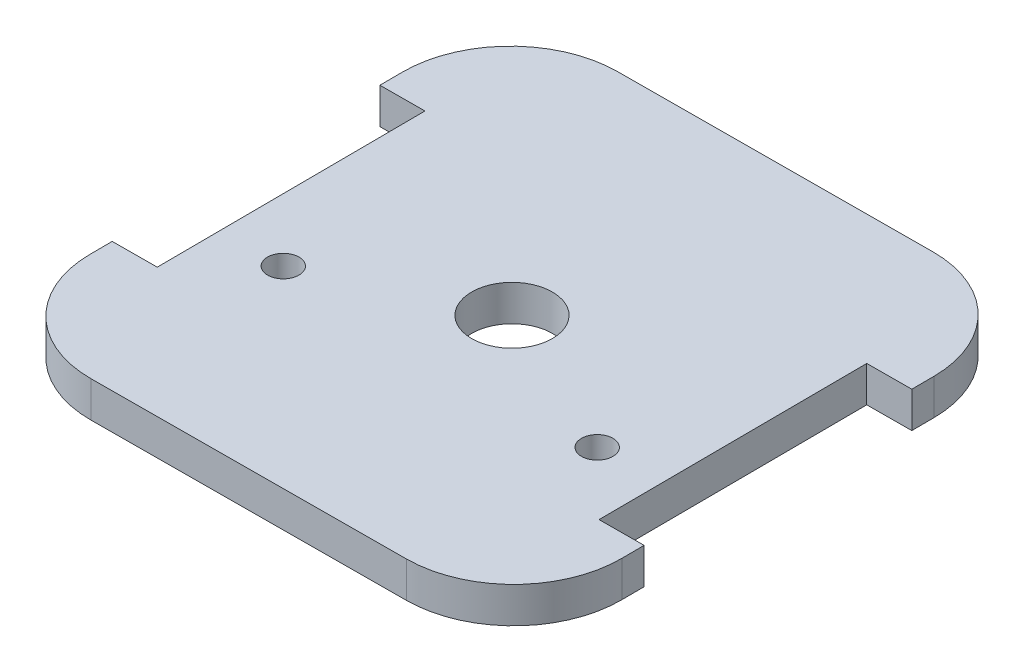
ISO-10303-21;
HEADER;
FILE_DESCRIPTION(('STEP AP214'),'2;1');
FILE_NAME('part.step','',(''),(''),'','','');
FILE_SCHEMA(('AUTOMOTIVE_DESIGN { 1 0 10303 214 1 1 1 1 }'));
ENDSEC;
DATA;
#1=APPLICATION_CONTEXT('core data for automotive mechanical design processes');
#2=APPLICATION_PROTOCOL_DEFINITION('international standard','automotive_design',2000,#1);
#3=PRODUCT_CONTEXT('',#1,'mechanical');
#4=PRODUCT('Part','Part','',(#3));
#5=PRODUCT_RELATED_PRODUCT_CATEGORY('part','',(#4));
#6=PRODUCT_DEFINITION_FORMATION('','',#4);
#7=PRODUCT_DEFINITION_CONTEXT('part definition',#1,'design');
#8=PRODUCT_DEFINITION('design','',#6,#7);
#9=PRODUCT_DEFINITION_SHAPE('','',#8);
#10=(LENGTH_UNIT() NAMED_UNIT(*) SI_UNIT(.MILLI.,.METRE.));
#11=(NAMED_UNIT(*) PLANE_ANGLE_UNIT() SI_UNIT($,.RADIAN.));
#12=(NAMED_UNIT(*) SI_UNIT($,.STERADIAN.) SOLID_ANGLE_UNIT());
#13=UNCERTAINTY_MEASURE_WITH_UNIT(LENGTH_MEASURE(1.E-05),#10,'distance_accuracy_value','');
#14=(GEOMETRIC_REPRESENTATION_CONTEXT(3) GLOBAL_UNCERTAINTY_ASSIGNED_CONTEXT((#13)) GLOBAL_UNIT_ASSIGNED_CONTEXT((#10,
#11,#12)) REPRESENTATION_CONTEXT('',''));
#15=CARTESIAN_POINT('',(0.,0.,0.));
#16=DIRECTION('',(0.,0.,1.));
#17=DIRECTION('',(1.,0.,0.));
#18=AXIS2_PLACEMENT_3D('',#15,#16,#17);
#19=CARTESIAN_POINT('',(17.1808532086742,4.,16.1819370143056));
#20=DIRECTION('',(0.,1.,0.));
#21=DIRECTION('',(0.,0.,1.));
#22=AXIS2_PLACEMENT_3D('',#19,#20,#21);
#23=PLANE('',#22);
#24=CARTESIAN_POINT('',(-17.9091860285323,4.,6.77244191439073));
#25=DIRECTION('',(0.,1.,0.));
#26=DIRECTION('',(0.,0.,1.));
#27=AXIS2_PLACEMENT_3D('',#24,#25,#26);
#28=CIRCLE('',#27,1.75);
#29=CARTESIAN_POINT('',(-17.9091860285323,4.,8.52244191439073));
#30=VERTEX_POINT('',#29);
#31=EDGE_CURVE('E274',#30,#30,#28,.T.);
#32=ORIENTED_EDGE('',*,*,#31,.F.);
#33=EDGE_LOOP('',(#32));
#34=FACE_BOUND('',#33,.T.);
#35=CARTESIAN_POINT('',(17.0908139714677,4.,6.77244191439073));
#36=DIRECTION('',(0.,1.,0.));
#37=DIRECTION('',(0.,0.,1.));
#38=AXIS2_PLACEMENT_3D('',#35,#36,#37);
#39=CIRCLE('',#38,1.75);
#40=CARTESIAN_POINT('',(17.0908139714677,4.,8.52244191439073));
#41=VERTEX_POINT('',#40);
#42=EDGE_CURVE('E194',#41,#41,#39,.T.);
#43=ORIENTED_EDGE('',*,*,#42,.F.);
#44=EDGE_LOOP('',(#43));
#45=FACE_BOUND('',#44,.T.);
#46=CARTESIAN_POINT('',(-0.409186028532349,4.,-1.22755808559696));
#47=DIRECTION('',(0.,1.,0.));
#48=DIRECTION('',(0.,0.,1.));
#49=AXIS2_PLACEMENT_3D('',#46,#47,#48);
#50=CIRCLE('',#49,4.5);
#51=CARTESIAN_POINT('',(-0.409186028532349,4.,3.27244191440304));
#52=VERTEX_POINT('',#51);
#53=EDGE_CURVE('E268',#52,#52,#50,.T.);
#54=ORIENTED_EDGE('',*,*,#53,.F.);
#55=EDGE_LOOP('',(#54));
#56=FACE_BOUND('',#55,.T.);
#57=DIRECTION('',(0.00515840392296965,0.,0.999986695345977));
#58=VECTOR('',#57,1.);
#59=CARTESIAN_POINT('',(-29.9990656098906,4.,-18.5751523384239));
#60=LINE('',#59,#58);
#61=CARTESIAN_POINT('',(-29.9990656098906,4.,-18.5751523384239));
#62=VERTEX_POINT('',#61);
#63=CARTESIAN_POINT('',(-29.9861706295586,4.,-16.0753851698693));
#64=VERTEX_POINT('',#63);
#65=EDGE_CURVE('E171',#62,#64,#60,.T.);
#66=ORIENTED_EDGE('',*,*,#65,.T.);
#67=DIRECTION('',(0.999986695345977,0.,-0.00515840392297031));
#68=VECTOR('',#67,1.);
#69=CARTESIAN_POINT('',(-0.0837201326007428,4.,-16.229636140075));
#70=LINE('',#69,#68);
#71=CARTESIAN_POINT('',(-24.9862371528287,4.,-16.1011771894842));
#72=VERTEX_POINT('',#71);
#73=EDGE_CURVE('E152',#64,#72,#70,.T.);
#74=ORIENTED_EDGE('',*,*,#73,.T.);
#75=DIRECTION('',(0.00515840392297073,0.,0.999986695345977));
#76=VECTOR('',#75,1.);
#77=CARTESIAN_POINT('',(-24.902517020228,4.,0.128458950590883));
#78=LINE('',#77,#76);
#79=CARTESIAN_POINT('',(-24.8314829761888,4.,13.8988228105158));
#80=VERTEX_POINT('',#79);
#81=EDGE_CURVE('E305',#72,#80,#78,.T.);
#82=ORIENTED_EDGE('',*,*,#81,.T.);
#83=DIRECTION('',(0.999986695345977,0.,-0.00515840392297124));
#84=VECTOR('',#83,1.);
#85=CARTESIAN_POINT('',(0.0710340440391579,4.,13.7703638599249));
#86=LINE('',#85,#84);
#87=CARTESIAN_POINT('',(-29.8314164529187,4.,13.9246148301307));
#88=VERTEX_POINT('',#87);
#89=EDGE_CURVE('E163',#88,#80,#86,.T.);
#90=ORIENTED_EDGE('',*,*,#89,.F.);
#91=CARTESIAN_POINT('',(-29.8185214725867,4.,16.4243819986851));
#92=VERTEX_POINT('',#91);
#93=EDGE_CURVE('E181',#88,#92,#60,.T.);
#94=ORIENTED_EDGE('',*,*,#93,.T.);
#95=CARTESIAN_POINT('',(-17.818681128435,4.,16.3624811516096));
#96=DIRECTION('',(0.,1.,0.));
#97=DIRECTION('',(0.,0.,1.));
#98=AXIS2_PLACEMENT_3D('',#95,#96,#97);
#99=CIRCLE('',#98,12.);
#100=CARTESIAN_POINT('',(-17.7567802813592,4.,28.3623214957613));
#101=VERTEX_POINT('',#100);
#102=EDGE_CURVE('E180',#92,#101,#99,.T.);
#103=ORIENTED_EDGE('',*,*,#102,.T.);
#104=DIRECTION('',(0.999986695345977,0.,-0.00515840392297005));
#105=VECTOR('',#104,1.);
#106=CARTESIAN_POINT('',(-17.7567802813592,4.,28.3623214957613));
#107=LINE('',#106,#105);
#108=CARTESIAN_POINT('',(17.2427540557498,4.,28.1817773584574));
#109=VERTEX_POINT('',#108);
#110=EDGE_CURVE('E183',#101,#109,#107,.T.);
#111=ORIENTED_EDGE('',*,*,#110,.T.);
#112=CARTESIAN_POINT('',(17.1808532086742,4.,16.1819370143056));
#113=DIRECTION('',(0.,1.,0.));
#114=DIRECTION('',(0.,0.,1.));
#115=AXIS2_PLACEMENT_3D('',#112,#113,#114);
#116=CIRCLE('',#115,12.);
#117=CARTESIAN_POINT('',(29.1806935528259,4.,16.12003616723));
#118=VERTEX_POINT('',#117);
#119=EDGE_CURVE('E210',#109,#118,#116,.T.);
#120=ORIENTED_EDGE('',*,*,#119,.T.);
#121=DIRECTION('',(-0.00515840392296844,0.,-0.999986695345977));
#122=VECTOR('',#121,1.);
#123=CARTESIAN_POINT('',(29.1806935528259,4.,16.12003616723));
#124=LINE('',#123,#122);
#125=CARTESIAN_POINT('',(29.1677985724939,4.,13.6202689986705));
#126=VERTEX_POINT('',#125);
#127=EDGE_CURVE('E287',#118,#126,#124,.T.);
#128=ORIENTED_EDGE('',*,*,#127,.T.);
#129=DIRECTION('',(-0.999986695345977,0.,0.00515840392296916));
#130=VECTOR('',#129,1.);
#131=CARTESIAN_POINT('',(0.0710340440391293,4.,13.7703638599249));
#132=LINE('',#131,#130);
#133=CARTESIAN_POINT('',(24.167865095764,4.,13.6460610182903));
#134=VERTEX_POINT('',#133);
#135=EDGE_CURVE('E55',#126,#134,#132,.T.);
#136=ORIENTED_EDGE('',*,*,#135,.T.);
#137=DIRECTION('',(0.00515840392296934,0.,0.999986695345977));
#138=VECTOR('',#137,1.);
#139=CARTESIAN_POINT('',(24.0968310517249,4.,-0.124302841634649));
#140=LINE('',#139,#138);
#141=CARTESIAN_POINT('',(24.0131109191242,4.,-16.3539389817097));
#142=VERTEX_POINT('',#141);
#143=EDGE_CURVE('E259',#142,#134,#140,.T.);
#144=ORIENTED_EDGE('',*,*,#143,.F.);
#145=DIRECTION('',(-0.999986695345977,0.,0.00515840392296963));
#146=VECTOR('',#145,1.);
#147=CARTESIAN_POINT('',(-0.0837201326007317,4.,-16.229636140075));
#148=LINE('',#147,#146);
#149=CARTESIAN_POINT('',(29.0130443958541,4.,-16.3797310013246));
#150=VERTEX_POINT('',#149);
#151=EDGE_CURVE('E255',#150,#142,#148,.T.);
#152=ORIENTED_EDGE('',*,*,#151,.F.);
#153=CARTESIAN_POINT('',(29.000149415522,4.,-18.879498169879));
#154=VERTEX_POINT('',#153);
#155=EDGE_CURVE('E286',#150,#154,#124,.T.);
#156=ORIENTED_EDGE('',*,*,#155,.T.);
#157=CARTESIAN_POINT('',(17.0003090713703,4.,-18.8175973228035));
#158=DIRECTION('',(0.,1.,0.));
#159=DIRECTION('',(0.,0.,1.));
#160=AXIS2_PLACEMENT_3D('',#157,#158,#159);
#161=CIRCLE('',#160,12.);
#162=CARTESIAN_POINT('',(16.9384082242946,4.,-30.8174376669553));
#163=VERTEX_POINT('',#162);
#164=EDGE_CURVE('E290',#154,#163,#161,.T.);
#165=ORIENTED_EDGE('',*,*,#164,.T.);
#166=DIRECTION('',(-0.999986695345977,0.,0.00515840392297005));
#167=VECTOR('',#166,1.);
#168=CARTESIAN_POINT('',(16.9384082242946,4.,-30.8174376669553));
#169=LINE('',#168,#167);
#170=CARTESIAN_POINT('',(-18.0611261128144,4.,-30.6368935296513));
#171=VERTEX_POINT('',#170);
#172=EDGE_CURVE('E291',#163,#171,#169,.T.);
#173=ORIENTED_EDGE('',*,*,#172,.T.);
#174=CARTESIAN_POINT('',(-17.9992252657389,4.,-18.6370531854996));
#175=DIRECTION('',(0.,1.,0.));
#176=DIRECTION('',(0.,0.,1.));
#177=AXIS2_PLACEMENT_3D('',#174,#175,#176);
#178=CIRCLE('',#177,12.);
#179=EDGE_CURVE('E178',#171,#62,#178,.T.);
#180=ORIENTED_EDGE('',*,*,#179,.T.);
#181=EDGE_LOOP('',(#66,#74,#82,#90,#94,#103,#111,#120,#128,#136,#144,#152,#156,#165,#173,#180));
#182=FACE_BOUND('',#181,.T.);
#183=ADVANCED_FACE('F40',(#34,#45,#56,#182),#23,.T.);
#184=CARTESIAN_POINT('',(17.1808532086742,0.,16.1819370143056));
#185=DIRECTION('',(0.,1.,0.));
#186=DIRECTION('',(0.,0.,1.));
#187=AXIS2_PLACEMENT_3D('',#184,#185,#186);
#188=PLANE('',#187);
#189=CARTESIAN_POINT('',(-0.409186028532349,0.,-1.22755808559696));
#190=DIRECTION('',(0.,1.,0.));
#191=DIRECTION('',(0.,0.,1.));
#192=AXIS2_PLACEMENT_3D('',#189,#190,#191);
#193=CIRCLE('',#192,4.5);
#194=CARTESIAN_POINT('',(-0.409186028532349,0.,3.27244191440304));
#195=VERTEX_POINT('',#194);
#196=EDGE_CURVE('E267',#195,#195,#193,.T.);
#197=ORIENTED_EDGE('',*,*,#196,.T.);
#198=EDGE_LOOP('',(#197));
#199=FACE_BOUND('',#198,.T.);
#200=CARTESIAN_POINT('',(-17.9091860285323,0.,6.77244191439073));
#201=DIRECTION('',(0.,1.,0.));
#202=DIRECTION('',(0.,0.,1.));
#203=AXIS2_PLACEMENT_3D('',#200,#201,#202);
#204=CIRCLE('',#203,1.75);
#205=CARTESIAN_POINT('',(-17.9091860285323,0.,8.52244191439073));
#206=VERTEX_POINT('',#205);
#207=EDGE_CURVE('E271',#206,#206,#204,.T.);
#208=ORIENTED_EDGE('',*,*,#207,.T.);
#209=EDGE_LOOP('',(#208));
#210=FACE_BOUND('',#209,.T.);
#211=CARTESIAN_POINT('',(17.0908139714677,0.,6.77244191439073));
#212=DIRECTION('',(0.,1.,0.));
#213=DIRECTION('',(0.,0.,1.));
#214=AXIS2_PLACEMENT_3D('',#211,#212,#213);
#215=CIRCLE('',#214,1.75);
#216=CARTESIAN_POINT('',(17.0908139714677,0.,8.52244191439073));
#217=VERTEX_POINT('',#216);
#218=EDGE_CURVE('E277',#217,#217,#215,.T.);
#219=ORIENTED_EDGE('',*,*,#218,.T.);
#220=EDGE_LOOP('',(#219));
#221=FACE_BOUND('',#220,.T.);
#222=DIRECTION('',(0.999986695345977,0.,-0.00515840392297031));
#223=VECTOR('',#222,1.);
#224=CARTESIAN_POINT('',(17.0132040517023,0.,-16.3178301542489));
#225=LINE('',#224,#223);
#226=CARTESIAN_POINT('',(-29.9861706295586,0.,-16.0753851698693));
#227=VERTEX_POINT('',#226);
#228=CARTESIAN_POINT('',(-24.9862371528287,0.,-16.1011771894842));
#229=VERTEX_POINT('',#228);
#230=EDGE_CURVE('E263',#227,#229,#225,.T.);
#231=ORIENTED_EDGE('',*,*,#230,.F.);
#232=DIRECTION('',(0.00515840392296965,0.,0.999986695345977));
#233=VECTOR('',#232,1.);
#234=CARTESIAN_POINT('',(-29.9990656098906,0.,-18.5751523384239));
#235=LINE('',#234,#233);
#236=CARTESIAN_POINT('',(-29.9990656098906,0.,-18.5751523384239));
#237=VERTEX_POINT('',#236);
#238=EDGE_CURVE('E173',#237,#227,#235,.T.);
#239=ORIENTED_EDGE('',*,*,#238,.F.);
#240=CARTESIAN_POINT('',(-17.9992252657389,0.,-18.6370531854996));
#241=DIRECTION('',(0.,1.,0.));
#242=DIRECTION('',(0.,0.,1.));
#243=AXIS2_PLACEMENT_3D('',#240,#241,#242);
#244=CIRCLE('',#243,12.);
#245=CARTESIAN_POINT('',(-18.0611261128144,0.,-30.6368935296513));
#246=VERTEX_POINT('',#245);
#247=EDGE_CURVE('E202',#246,#237,#244,.T.);
#248=ORIENTED_EDGE('',*,*,#247,.F.);
#249=DIRECTION('',(-0.999986695345977,0.,0.00515840392297005));
#250=VECTOR('',#249,1.);
#251=CARTESIAN_POINT('',(16.9384082242946,0.,-30.8174376669553));
#252=LINE('',#251,#250);
#253=CARTESIAN_POINT('',(16.9384082242946,0.,-30.8174376669553));
#254=VERTEX_POINT('',#253);
#255=EDGE_CURVE('E200',#254,#246,#252,.T.);
#256=ORIENTED_EDGE('',*,*,#255,.F.);
#257=CARTESIAN_POINT('',(17.0003090713703,0.,-18.8175973228035));
#258=DIRECTION('',(0.,1.,0.));
#259=DIRECTION('',(0.,0.,1.));
#260=AXIS2_PLACEMENT_3D('',#257,#258,#259);
#261=CIRCLE('',#260,12.);
#262=CARTESIAN_POINT('',(29.000149415522,0.,-18.879498169879));
#263=VERTEX_POINT('',#262);
#264=EDGE_CURVE('E198',#263,#254,#261,.T.);
#265=ORIENTED_EDGE('',*,*,#264,.F.);
#266=DIRECTION('',(-0.00515840392297006,0.,-0.999986695345977));
#267=VECTOR('',#266,1.);
#268=CARTESIAN_POINT('',(29.090421484174,0.,-1.3797310013246));
#269=LINE('',#268,#267);
#270=CARTESIAN_POINT('',(29.0130443958541,0.,-16.3797310013246));
#271=VERTEX_POINT('',#270);
#272=EDGE_CURVE('E193',#271,#263,#269,.T.);
#273=ORIENTED_EDGE('',*,*,#272,.F.);
#274=DIRECTION('',(-0.999986695345977,0.,0.00515840392296963));
#275=VECTOR('',#274,1.);
#276=CARTESIAN_POINT('',(17.0132040517023,0.,-16.3178301542489));
#277=LINE('',#276,#275);
#278=CARTESIAN_POINT('',(24.0131109191242,0.,-16.3539389817097));
#279=VERTEX_POINT('',#278);
#280=EDGE_CURVE('E244',#271,#279,#277,.T.);
#281=ORIENTED_EDGE('',*,*,#280,.T.);
#282=DIRECTION('',(0.00515840392296934,0.,0.999986695345977));
#283=VECTOR('',#282,1.);
#284=CARTESIAN_POINT('',(24.1807600760961,0.,16.1458281868449));
#285=LINE('',#284,#283);
#286=CARTESIAN_POINT('',(24.167865095764,0.,13.6460610182903));
#287=VERTEX_POINT('',#286);
#288=EDGE_CURVE('E48',#279,#287,#285,.T.);
#289=ORIENTED_EDGE('',*,*,#288,.T.);
#290=DIRECTION('',(-0.999986695345977,0.,0.00515840392296916));
#291=VECTOR('',#290,1.);
#292=CARTESIAN_POINT('',(17.1679582283422,0.,13.6821698457511));
#293=LINE('',#292,#291);
#294=CARTESIAN_POINT('',(29.1677985724939,0.,13.6202689986755));
#295=VERTEX_POINT('',#294);
#296=EDGE_CURVE('E242',#295,#287,#293,.T.);
#297=ORIENTED_EDGE('',*,*,#296,.F.);
#298=CARTESIAN_POINT('',(29.1806935528259,0.,16.12003616723));
#299=VERTEX_POINT('',#298);
#300=EDGE_CURVE('E195',#299,#295,#269,.T.);
#301=ORIENTED_EDGE('',*,*,#300,.F.);
#302=CARTESIAN_POINT('',(17.1808532086742,0.,16.1819370143056));
#303=DIRECTION('',(0.,1.,0.));
#304=DIRECTION('',(0.,0.,1.));
#305=AXIS2_PLACEMENT_3D('',#302,#303,#304);
#306=CIRCLE('',#305,12.);
#307=CARTESIAN_POINT('',(17.2427540557498,0.,28.1817773584574));
#308=VERTEX_POINT('',#307);
#309=EDGE_CURVE('E190',#308,#299,#306,.T.);
#310=ORIENTED_EDGE('',*,*,#309,.F.);
#311=DIRECTION('',(0.999986695345977,0.,-0.00515840392297005));
#312=VECTOR('',#311,1.);
#313=CARTESIAN_POINT('',(-17.7567802813592,0.,28.3623214957613));
#314=LINE('',#313,#312);
#315=CARTESIAN_POINT('',(-17.7567802813592,0.,28.3623214957613));
#316=VERTEX_POINT('',#315);
#317=EDGE_CURVE('E208',#316,#308,#314,.T.);
#318=ORIENTED_EDGE('',*,*,#317,.F.);
#319=CARTESIAN_POINT('',(-17.818681128435,0.,16.3624811516096));
#320=DIRECTION('',(0.,1.,0.));
#321=DIRECTION('',(0.,0.,1.));
#322=AXIS2_PLACEMENT_3D('',#319,#320,#321);
#323=CIRCLE('',#322,12.);
#324=CARTESIAN_POINT('',(-29.8185214725867,0.,16.4243819986851));
#325=VERTEX_POINT('',#324);
#326=EDGE_CURVE('E206',#325,#316,#323,.T.);
#327=ORIENTED_EDGE('',*,*,#326,.F.);
#328=CARTESIAN_POINT('',(-29.8314164529187,0.,13.9246148301307));
#329=VERTEX_POINT('',#328);
#330=EDGE_CURVE('E204',#329,#325,#235,.T.);
#331=ORIENTED_EDGE('',*,*,#330,.F.);
#332=DIRECTION('',(0.999986695345977,0.,-0.00515840392297124));
#333=VECTOR('',#332,1.);
#334=CARTESIAN_POINT('',(17.1679582283422,0.,13.682169845751));
#335=LINE('',#334,#333);
#336=CARTESIAN_POINT('',(-24.8314829761888,0.,13.8988228105158));
#337=VERTEX_POINT('',#336);
#338=EDGE_CURVE('E63',#329,#337,#335,.T.);
#339=ORIENTED_EDGE('',*,*,#338,.T.);
#340=DIRECTION('',(0.00515840392297073,0.,0.999986695345977));
#341=VECTOR('',#340,1.);
#342=CARTESIAN_POINT('',(-24.8185879958568,0.,16.3985899790704));
#343=LINE('',#342,#341);
#344=EDGE_CURVE('E11',#229,#337,#343,.T.);
#345=ORIENTED_EDGE('',*,*,#344,.F.);
#346=EDGE_LOOP('',(#231,#239,#248,#256,#265,#273,#281,#289,#297,#301,#310,#318,#327,#331,#339,#345));
#347=FACE_BOUND('',#346,.T.);
#348=ADVANCED_FACE('F241',(#199,#210,#221,#347),#188,.F.);
#349=CARTESIAN_POINT('',(29.090421484174,4.,-1.3797310013246));
#350=DIRECTION('',(-0.999986695345977,0.,0.00515840392297006));
#351=DIRECTION('',(0.00515840392297006,0.,0.999986695345977));
#352=AXIS2_PLACEMENT_3D('',#349,#350,#351);
#353=PLANE('',#352);
#354=DIRECTION('',(0.,-1.,0.));
#355=VECTOR('',#354,1.);
#356=CARTESIAN_POINT('',(29.1677985724939,4.,13.6202689986754));
#357=LINE('',#356,#355);
#358=EDGE_CURVE('E174',#126,#295,#357,.T.);
#359=ORIENTED_EDGE('',*,*,#358,.F.);
#360=ORIENTED_EDGE('',*,*,#127,.F.);
#361=DIRECTION('',(0.,-1.,0.));
#362=VECTOR('',#361,1.);
#363=CARTESIAN_POINT('',(29.1806935528259,4.,16.12003616723));
#364=LINE('',#363,#362);
#365=EDGE_CURVE('E230',#118,#299,#364,.T.);
#366=ORIENTED_EDGE('',*,*,#365,.T.);
#367=ORIENTED_EDGE('',*,*,#300,.T.);
#368=EDGE_LOOP('',(#359,#360,#366,#367));
#369=FACE_BOUND('',#368,.T.);
#370=ADVANCED_FACE('F316',(#369),#353,.F.);
#371=CARTESIAN_POINT('',(-29.9990656098906,4.,-18.5751523384239));
#372=DIRECTION('',(0.999986695345977,0.,-0.00515840392296965));
#373=DIRECTION('',(-0.00515840392296965,0.,-0.999986695345977));
#374=AXIS2_PLACEMENT_3D('',#371,#372,#373);
#375=PLANE('',#374);
#376=DIRECTION('',(0.,-1.,0.));
#377=VECTOR('',#376,1.);
#378=CARTESIAN_POINT('',(-29.9861706295586,4.,-16.0753851698693));
#379=LINE('',#378,#377);
#380=EDGE_CURVE('E155',#64,#227,#379,.T.);
#381=ORIENTED_EDGE('',*,*,#380,.F.);
#382=ORIENTED_EDGE('',*,*,#65,.F.);
#383=DIRECTION('',(0.,-1.,0.));
#384=VECTOR('',#383,1.);
#385=CARTESIAN_POINT('',(-29.9990656098906,4.,-18.5751523384239));
#386=LINE('',#385,#384);
#387=EDGE_CURVE('E219',#62,#237,#386,.T.);
#388=ORIENTED_EDGE('',*,*,#387,.T.);
#389=ORIENTED_EDGE('',*,*,#238,.T.);
#390=EDGE_LOOP('',(#381,#382,#388,#389));
#391=FACE_BOUND('',#390,.T.);
#392=ADVANCED_FACE('F169',(#391),#375,.F.);
#393=CARTESIAN_POINT('',(17.1808532086742,4.,16.1819370143056));
#394=DIRECTION('',(0.,-1.,0.));
#395=DIRECTION('',(0.,0.,-1.));
#396=AXIS2_PLACEMENT_3D('',#393,#394,#395);
#397=CYLINDRICAL_SURFACE('',#396,12.);
#398=ORIENTED_EDGE('',*,*,#309,.T.);
#399=ORIENTED_EDGE('',*,*,#365,.F.);
#400=ORIENTED_EDGE('',*,*,#119,.F.);
#401=DIRECTION('',(0.,-1.,0.));
#402=VECTOR('',#401,1.);
#403=CARTESIAN_POINT('',(17.2427540557498,4.,28.1817773584574));
#404=LINE('',#403,#402);
#405=EDGE_CURVE('E189',#109,#308,#404,.T.);
#406=ORIENTED_EDGE('',*,*,#405,.T.);
#407=EDGE_LOOP('',(#398,#399,#400,#406));
#408=FACE_BOUND('',#407,.T.);
#409=ADVANCED_FACE('F42',(#408),#397,.T.);
#410=ORIENTED_EDGE('',*,*,#155,.F.);
#411=DIRECTION('',(0.,-1.,0.));
#412=VECTOR('',#411,1.);
#413=CARTESIAN_POINT('',(29.0130443958541,4.,-16.3797310013245));
#414=LINE('',#413,#412);
#415=EDGE_CURVE('E235',#150,#271,#414,.T.);
#416=ORIENTED_EDGE('',*,*,#415,.T.);
#417=ORIENTED_EDGE('',*,*,#272,.T.);
#418=DIRECTION('',(0.,-1.,0.));
#419=VECTOR('',#418,1.);
#420=CARTESIAN_POINT('',(29.000149415522,4.,-18.879498169879));
#421=LINE('',#420,#419);
#422=EDGE_CURVE('E227',#154,#263,#421,.T.);
#423=ORIENTED_EDGE('',*,*,#422,.F.);
#424=EDGE_LOOP('',(#410,#416,#417,#423));
#425=FACE_BOUND('',#424,.T.);
#426=ADVANCED_FACE('F358',(#425),#353,.F.);
#427=CARTESIAN_POINT('',(17.0003090713703,4.,-18.8175973228035));
#428=DIRECTION('',(0.,-1.,0.));
#429=DIRECTION('',(0.,0.,-1.));
#430=AXIS2_PLACEMENT_3D('',#427,#428,#429);
#431=CYLINDRICAL_SURFACE('',#430,12.);
#432=ORIENTED_EDGE('',*,*,#264,.T.);
#433=DIRECTION('',(0.,-1.,0.));
#434=VECTOR('',#433,1.);
#435=CARTESIAN_POINT('',(16.9384082242946,4.,-30.8174376669553));
#436=LINE('',#435,#434);
#437=EDGE_CURVE('E224',#163,#254,#436,.T.);
#438=ORIENTED_EDGE('',*,*,#437,.F.);
#439=ORIENTED_EDGE('',*,*,#164,.F.);
#440=ORIENTED_EDGE('',*,*,#422,.T.);
#441=EDGE_LOOP('',(#432,#438,#439,#440));
#442=FACE_BOUND('',#441,.T.);
#443=ADVANCED_FACE('F356',(#442),#431,.T.);
#444=CARTESIAN_POINT('',(16.9384082242946,4.,-30.8174376669553));
#445=DIRECTION('',(0.00515840392297005,0.,0.999986695345977));
#446=DIRECTION('',(0.999986695345977,0.,-0.00515840392297005));
#447=AXIS2_PLACEMENT_3D('',#444,#445,#446);
#448=PLANE('',#447);
#449=ORIENTED_EDGE('',*,*,#255,.T.);
#450=DIRECTION('',(0.,-1.,0.));
#451=VECTOR('',#450,1.);
#452=CARTESIAN_POINT('',(-18.0611261128144,4.,-30.6368935296513));
#453=LINE('',#452,#451);
#454=EDGE_CURVE('E221',#171,#246,#453,.T.);
#455=ORIENTED_EDGE('',*,*,#454,.F.);
#456=ORIENTED_EDGE('',*,*,#172,.F.);
#457=ORIENTED_EDGE('',*,*,#437,.T.);
#458=EDGE_LOOP('',(#449,#455,#456,#457));
#459=FACE_BOUND('',#458,.T.);
#460=ADVANCED_FACE('F297',(#459),#448,.F.);
#461=CARTESIAN_POINT('',(-17.9992252657389,4.,-18.6370531854996));
#462=DIRECTION('',(0.,-1.,0.));
#463=DIRECTION('',(0.,0.,-1.));
#464=AXIS2_PLACEMENT_3D('',#461,#462,#463);
#465=CYLINDRICAL_SURFACE('',#464,12.);
#466=ORIENTED_EDGE('',*,*,#247,.T.);
#467=ORIENTED_EDGE('',*,*,#387,.F.);
#468=ORIENTED_EDGE('',*,*,#179,.F.);
#469=ORIENTED_EDGE('',*,*,#454,.T.);
#470=EDGE_LOOP('',(#466,#467,#468,#469));
#471=FACE_BOUND('',#470,.T.);
#472=ADVANCED_FACE('F301',(#471),#465,.T.);
#473=ORIENTED_EDGE('',*,*,#93,.F.);
#474=DIRECTION('',(0.,-1.,0.));
#475=VECTOR('',#474,1.);
#476=CARTESIAN_POINT('',(-29.8314164529187,4.,13.9246148301307));
#477=LINE('',#476,#475);
#478=EDGE_CURVE('E175',#88,#329,#477,.T.);
#479=ORIENTED_EDGE('',*,*,#478,.T.);
#480=ORIENTED_EDGE('',*,*,#330,.T.);
#481=DIRECTION('',(0.,-1.,0.));
#482=VECTOR('',#481,1.);
#483=CARTESIAN_POINT('',(-29.8185214725867,4.,16.4243819986851));
#484=LINE('',#483,#482);
#485=EDGE_CURVE('E216',#92,#325,#484,.T.);
#486=ORIENTED_EDGE('',*,*,#485,.F.);
#487=EDGE_LOOP('',(#473,#479,#480,#486));
#488=FACE_BOUND('',#487,.T.);
#489=ADVANCED_FACE('F347',(#488),#375,.F.);
#490=CARTESIAN_POINT('',(-17.818681128435,4.,16.3624811516096));
#491=DIRECTION('',(0.,-1.,0.));
#492=DIRECTION('',(0.,0.,-1.));
#493=AXIS2_PLACEMENT_3D('',#490,#491,#492);
#494=CYLINDRICAL_SURFACE('',#493,12.);
#495=ORIENTED_EDGE('',*,*,#326,.T.);
#496=DIRECTION('',(0.,-1.,0.));
#497=VECTOR('',#496,1.);
#498=CARTESIAN_POINT('',(-17.7567802813592,4.,28.3623214957613));
#499=LINE('',#498,#497);
#500=EDGE_CURVE('E213',#101,#316,#499,.T.);
#501=ORIENTED_EDGE('',*,*,#500,.F.);
#502=ORIENTED_EDGE('',*,*,#102,.F.);
#503=ORIENTED_EDGE('',*,*,#485,.T.);
#504=EDGE_LOOP('',(#495,#501,#502,#503));
#505=FACE_BOUND('',#504,.T.);
#506=ADVANCED_FACE('F343',(#505),#494,.T.);
#507=CARTESIAN_POINT('',(-17.7567802813592,4.,28.3623214957613));
#508=DIRECTION('',(-0.00515840392297005,0.,-0.999986695345977));
#509=DIRECTION('',(-0.999986695345977,0.,0.00515840392297005));
#510=AXIS2_PLACEMENT_3D('',#507,#508,#509);
#511=PLANE('',#510);
#512=ORIENTED_EDGE('',*,*,#317,.T.);
#513=ORIENTED_EDGE('',*,*,#405,.F.);
#514=ORIENTED_EDGE('',*,*,#110,.F.);
#515=ORIENTED_EDGE('',*,*,#500,.T.);
#516=EDGE_LOOP('',(#512,#513,#514,#515));
#517=FACE_BOUND('',#516,.T.);
#518=ADVANCED_FACE('F340',(#517),#511,.F.);
#519=CARTESIAN_POINT('',(17.0908139714677,4.,6.77244191439073));
#520=DIRECTION('',(0.,-1.,0.));
#521=DIRECTION('',(0.,0.,-1.));
#522=AXIS2_PLACEMENT_3D('',#519,#520,#521);
#523=CYLINDRICAL_SURFACE('',#522,1.75);
#524=ORIENTED_EDGE('',*,*,#218,.F.);
#525=EDGE_LOOP('',(#524));
#526=FACE_BOUND('',#525,.T.);
#527=ORIENTED_EDGE('',*,*,#42,.T.);
#528=EDGE_LOOP('',(#527));
#529=FACE_BOUND('',#528,.T.);
#530=ADVANCED_FACE('F337',(#526,#529),#523,.F.);
#531=CARTESIAN_POINT('',(-17.9091860285323,4.,6.77244191439073));
#532=DIRECTION('',(0.,-1.,0.));
#533=DIRECTION('',(0.,0.,-1.));
#534=AXIS2_PLACEMENT_3D('',#531,#532,#533);
#535=CYLINDRICAL_SURFACE('',#534,1.75);
#536=ORIENTED_EDGE('',*,*,#207,.F.);
#537=EDGE_LOOP('',(#536));
#538=FACE_BOUND('',#537,.T.);
#539=ORIENTED_EDGE('',*,*,#31,.T.);
#540=EDGE_LOOP('',(#539));
#541=FACE_BOUND('',#540,.T.);
#542=ADVANCED_FACE('F427',(#538,#541),#535,.F.);
#543=CARTESIAN_POINT('',(-0.409186028532349,4.,-1.22755808559696));
#544=DIRECTION('',(0.,-1.,0.));
#545=DIRECTION('',(0.,0.,-1.));
#546=AXIS2_PLACEMENT_3D('',#543,#544,#545);
#547=CYLINDRICAL_SURFACE('',#546,4.5);
#548=ORIENTED_EDGE('',*,*,#196,.F.);
#549=EDGE_LOOP('',(#548));
#550=FACE_BOUND('',#549,.T.);
#551=ORIENTED_EDGE('',*,*,#53,.T.);
#552=EDGE_LOOP('',(#551));
#553=FACE_BOUND('',#552,.T.);
#554=ADVANCED_FACE('F436',(#550,#553),#547,.F.);
#555=CARTESIAN_POINT('',(-24.902517020228,-28.,0.128458950590883));
#556=DIRECTION('',(-0.999986695345977,0.,0.00515840392297073));
#557=DIRECTION('',(0.00515840392297073,0.,0.999986695345977));
#558=AXIS2_PLACEMENT_3D('',#555,#556,#557);
#559=PLANE('',#558);
#560=ORIENTED_EDGE('',*,*,#344,.T.);
#561=DIRECTION('',(0.,1.,0.));
#562=VECTOR('',#561,1.);
#563=CARTESIAN_POINT('',(-24.8314829761888,-28.,13.8988228105158));
#564=LINE('',#563,#562);
#565=EDGE_CURVE('E306',#337,#80,#564,.T.);
#566=ORIENTED_EDGE('',*,*,#565,.T.);
#567=ORIENTED_EDGE('',*,*,#81,.F.);
#568=DIRECTION('',(0.,1.,0.));
#569=VECTOR('',#568,1.);
#570=CARTESIAN_POINT('',(-24.9862371528287,-28.,-16.1011771894842));
#571=LINE('',#570,#569);
#572=EDGE_CURVE('E158',#229,#72,#571,.T.);
#573=ORIENTED_EDGE('',*,*,#572,.F.);
#574=EDGE_LOOP('',(#560,#566,#567,#573));
#575=FACE_BOUND('',#574,.T.);
#576=ADVANCED_FACE('F304',(#575),#559,.T.);
#577=CARTESIAN_POINT('',(-0.0837201326007428,-28.,-16.229636140075));
#578=DIRECTION('',(0.00515840392297031,0.,0.999986695345977));
#579=DIRECTION('',(0.999986695345977,0.,-0.00515840392297031));
#580=AXIS2_PLACEMENT_3D('',#577,#578,#579);
#581=PLANE('',#580);
#582=ORIENTED_EDGE('',*,*,#230,.T.);
#583=ORIENTED_EDGE('',*,*,#572,.T.);
#584=ORIENTED_EDGE('',*,*,#73,.F.);
#585=ORIENTED_EDGE('',*,*,#380,.T.);
#586=EDGE_LOOP('',(#582,#583,#584,#585));
#587=FACE_BOUND('',#586,.T.);
#588=ADVANCED_FACE('F154',(#587),#581,.T.);
#589=CARTESIAN_POINT('',(0.0710340440391579,-28.,13.7703638599249));
#590=DIRECTION('',(0.00515840392297124,0.,0.999986695345977));
#591=DIRECTION('',(0.999986695345977,0.,-0.00515840392297124));
#592=AXIS2_PLACEMENT_3D('',#589,#590,#591);
#593=PLANE('',#592);
#594=ORIENTED_EDGE('',*,*,#478,.F.);
#595=ORIENTED_EDGE('',*,*,#89,.T.);
#596=ORIENTED_EDGE('',*,*,#565,.F.);
#597=ORIENTED_EDGE('',*,*,#338,.F.);
#598=EDGE_LOOP('',(#594,#595,#596,#597));
#599=FACE_BOUND('',#598,.T.);
#600=ADVANCED_FACE('F462',(#599),#593,.F.);
#601=CARTESIAN_POINT('',(24.0968310517249,-28.,-0.124302841634649));
#602=DIRECTION('',(-0.999986695345977,0.,0.00515840392296934));
#603=DIRECTION('',(0.00515840392296934,0.,0.999986695345977));
#604=AXIS2_PLACEMENT_3D('',#601,#602,#603);
#605=PLANE('',#604);
#606=DIRECTION('',(0.,1.,0.));
#607=VECTOR('',#606,1.);
#608=CARTESIAN_POINT('',(24.0131109191242,-28.,-16.3539389817097));
#609=LINE('',#608,#607);
#610=EDGE_CURVE('E250',#279,#142,#609,.T.);
#611=ORIENTED_EDGE('',*,*,#610,.T.);
#612=ORIENTED_EDGE('',*,*,#143,.T.);
#613=DIRECTION('',(0.,1.,0.));
#614=VECTOR('',#613,1.);
#615=CARTESIAN_POINT('',(24.167865095764,-28.,13.6460610182903));
#616=LINE('',#615,#614);
#617=EDGE_CURVE('E164',#287,#134,#616,.T.);
#618=ORIENTED_EDGE('',*,*,#617,.F.);
#619=ORIENTED_EDGE('',*,*,#288,.F.);
#620=EDGE_LOOP('',(#611,#612,#618,#619));
#621=FACE_BOUND('',#620,.T.);
#622=ADVANCED_FACE('F248',(#621),#605,.F.);
#623=CARTESIAN_POINT('',(-0.0837201326007317,-28.,-16.229636140075));
#624=DIRECTION('',(-0.00515840392296962,0.,-0.999986695345977));
#625=DIRECTION('',(-0.999986695345977,0.,0.00515840392296963));
#626=AXIS2_PLACEMENT_3D('',#623,#624,#625);
#627=PLANE('',#626);
#628=ORIENTED_EDGE('',*,*,#415,.F.);
#629=ORIENTED_EDGE('',*,*,#151,.T.);
#630=ORIENTED_EDGE('',*,*,#610,.F.);
#631=ORIENTED_EDGE('',*,*,#280,.F.);
#632=EDGE_LOOP('',(#628,#629,#630,#631));
#633=FACE_BOUND('',#632,.T.);
#634=ADVANCED_FACE('F253',(#633),#627,.F.);
#635=CARTESIAN_POINT('',(0.0710340440391293,-28.,13.7703638599249));
#636=DIRECTION('',(-0.00515840392296916,0.,-0.999986695345977));
#637=DIRECTION('',(-0.999986695345977,0.,0.00515840392296916));
#638=AXIS2_PLACEMENT_3D('',#635,#636,#637);
#639=PLANE('',#638);
#640=ORIENTED_EDGE('',*,*,#296,.T.);
#641=ORIENTED_EDGE('',*,*,#617,.T.);
#642=ORIENTED_EDGE('',*,*,#135,.F.);
#643=ORIENTED_EDGE('',*,*,#358,.T.);
#644=EDGE_LOOP('',(#640,#641,#642,#643));
#645=FACE_BOUND('',#644,.T.);
#646=ADVANCED_FACE('F317',(#645),#639,.T.);
#647=CLOSED_SHELL('',(#183,#348,#370,#392,#409,#426,#443,#460,#472,#489,#506,#518,#530,#542,
#554,#576,#588,#600,#622,#634,#646));
#648=MANIFOLD_SOLID_BREP('B2',#647);
#649=ADVANCED_BREP_SHAPE_REPRESENTATION('',(#18,#648),#14);
#650=SHAPE_DEFINITION_REPRESENTATION(#9,#649);
ENDSEC;
END-ISO-10303-21;
